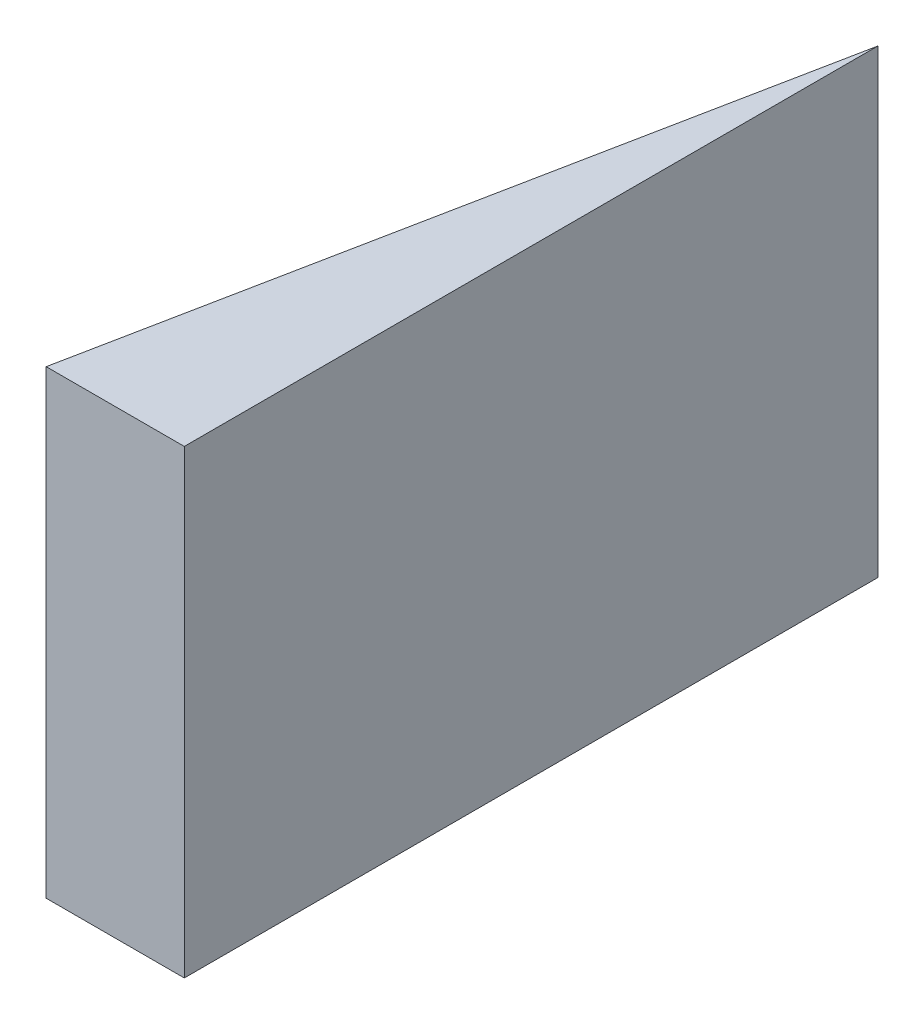
ISO-10303-21;
HEADER;
FILE_DESCRIPTION(('STEP AP214'),'2;1');
FILE_NAME('part.step','',(''),(''),'','','');
FILE_SCHEMA(('AUTOMOTIVE_DESIGN { 1 0 10303 214 1 1 1 1 }'));
ENDSEC;
DATA;
#1=APPLICATION_CONTEXT('core data for automotive mechanical design processes');
#2=APPLICATION_PROTOCOL_DEFINITION('international standard','automotive_design',2000,#1);
#3=PRODUCT_CONTEXT('',#1,'mechanical');
#4=PRODUCT('Part','Part','',(#3));
#5=PRODUCT_RELATED_PRODUCT_CATEGORY('part','',(#4));
#6=PRODUCT_DEFINITION_FORMATION('','',#4);
#7=PRODUCT_DEFINITION_CONTEXT('part definition',#1,'design');
#8=PRODUCT_DEFINITION('design','',#6,#7);
#9=PRODUCT_DEFINITION_SHAPE('','',#8);
#10=(LENGTH_UNIT() NAMED_UNIT(*) SI_UNIT(.MILLI.,.METRE.));
#11=(NAMED_UNIT(*) PLANE_ANGLE_UNIT() SI_UNIT($,.RADIAN.));
#12=(NAMED_UNIT(*) SI_UNIT($,.STERADIAN.) SOLID_ANGLE_UNIT());
#13=UNCERTAINTY_MEASURE_WITH_UNIT(LENGTH_MEASURE(1.E-05),#10,'distance_accuracy_value','');
#14=(GEOMETRIC_REPRESENTATION_CONTEXT(3) GLOBAL_UNCERTAINTY_ASSIGNED_CONTEXT((#13)) GLOBAL_UNIT_ASSIGNED_CONTEXT((#10,
#11,#12)) REPRESENTATION_CONTEXT('',''));
#15=CARTESIAN_POINT('',(0.,0.,0.));
#16=DIRECTION('',(0.,0.,1.));
#17=DIRECTION('',(1.,0.,0.));
#18=AXIS2_PLACEMENT_3D('',#15,#16,#17);
#19=CARTESIAN_POINT('',(-3.37532170631,1.74999995469266,-5.23287720051423));
#20=DIRECTION('',(0.,-1.,-8.74227765734759E-08));
#21=DIRECTION('',(1.,0.,0.));
#22=AXIS2_PLACEMENT_3D('',#19,#20,#21);
#23=PLANE('',#22);
#24=DIRECTION('',(-1.,0.,0.));
#25=VECTOR('',#24,1.);
#26=CARTESIAN_POINT('',(-3.,1.74999981641117,-3.65112136800623));
#27=LINE('',#26,#25);
#28=CARTESIAN_POINT('',(-3.,1.74999981641017,-3.65112136800623));
#29=VERTEX_POINT('',#28);
#30=CARTESIAN_POINT('',(-3.3,1.74999981641017,-3.65112136800723));
#31=VERTEX_POINT('',#30);
#32=EDGE_CURVE('E11',#29,#31,#27,.T.);
#33=ORIENTED_EDGE('',*,*,#32,.F.);
#34=DIRECTION('',(0.,-8.74227765663743E-08,0.999999999999996));
#35=VECTOR('',#34,1.);
#36=CARTESIAN_POINT('',(-3.,1.74999994810782,-5.15755549420424));
#37=LINE('',#36,#35);
#38=CARTESIAN_POINT('',(-3.,1.74999994810682,-5.15755549420324));
#39=VERTEX_POINT('',#38);
#40=EDGE_CURVE('E63',#39,#29,#37,.T.);
#41=ORIENTED_EDGE('',*,*,#40,.F.);
#42=DIRECTION('',(0.195310522456618,8.57391410123929E-08,-0.980741454114037));
#43=VECTOR('',#42,1.);
#44=CARTESIAN_POINT('',(-3.3,1.74999981641117,-3.65112136800623));
#45=LINE('',#44,#43);
#46=EDGE_CURVE('E70',#31,#39,#45,.T.);
#47=ORIENTED_EDGE('',*,*,#46,.F.);
#48=EDGE_LOOP('',(#33,#41,#47));
#49=FACE_BOUND('',#48,.T.);
#50=ADVANCED_FACE('F17',(#49),#23,.F.);
#51=CARTESIAN_POINT('',(-3.37532170631,0.749999954692656,-5.23287728793701));
#52=DIRECTION('',(0.,-1.,-8.74227765734759E-08));
#53=DIRECTION('',(1.,0.,0.));
#54=AXIS2_PLACEMENT_3D('',#51,#52,#53);
#55=PLANE('',#54);
#56=DIRECTION('',(0.195310522456618,8.57391410123928E-08,-0.980741454114037));
#57=VECTOR('',#56,1.);
#58=CARTESIAN_POINT('',(-3.3,0.749999816411169,-3.65112145542901));
#59=LINE('',#58,#57);
#60=CARTESIAN_POINT('',(-3.3,0.749999816412169,-3.65112145543001));
#61=VERTEX_POINT('',#60);
#62=CARTESIAN_POINT('',(-3.,0.749999948108823,-5.15755558162601));
#63=VERTEX_POINT('',#62);
#64=EDGE_CURVE('E24',#61,#63,#59,.T.);
#65=ORIENTED_EDGE('',*,*,#64,.T.);
#66=DIRECTION('',(0.,-8.74227765663743E-08,0.999999999999996));
#67=VECTOR('',#66,1.);
#68=CARTESIAN_POINT('',(-3.,0.749999948107823,-5.15755558162701));
#69=LINE('',#68,#67);
#70=CARTESIAN_POINT('',(-3.,0.749999816412169,-3.65112145542901));
#71=VERTEX_POINT('',#70);
#72=EDGE_CURVE('E49',#63,#71,#69,.T.);
#73=ORIENTED_EDGE('',*,*,#72,.T.);
#74=DIRECTION('',(-1.,0.,0.));
#75=VECTOR('',#74,1.);
#76=CARTESIAN_POINT('',(-3.,0.749999816411169,-3.65112145542901));
#77=LINE('',#76,#75);
#78=EDGE_CURVE('E46',#71,#61,#77,.T.);
#79=ORIENTED_EDGE('',*,*,#78,.T.);
#80=EDGE_LOOP('',(#65,#73,#79));
#81=FACE_BOUND('',#80,.T.);
#82=ADVANCED_FACE('F47',(#81),#55,.T.);
#83=CARTESIAN_POINT('',(-3.3,1.74999981641117,-3.65112136800623));
#84=DIRECTION('',(-0.980741454114041,1.70745881893227E-08,-0.195310522456619));
#85=DIRECTION('',(0.195310522456619,8.57391410193576E-08,-0.980741454114041));
#86=AXIS2_PLACEMENT_3D('',#83,#84,#85);
#87=PLANE('',#86);
#88=ORIENTED_EDGE('',*,*,#46,.T.);
#89=DIRECTION('',(0.,-0.999999999999996,-8.74227765734756E-08));
#90=VECTOR('',#89,1.);
#91=CARTESIAN_POINT('',(-3.,1.74999994810782,-5.15755549420423));
#92=LINE('',#91,#90);
#93=EDGE_CURVE('E54',#39,#63,#92,.T.);
#94=ORIENTED_EDGE('',*,*,#93,.T.);
#95=ORIENTED_EDGE('',*,*,#64,.F.);
#96=DIRECTION('',(0.,-0.999999999999996,-8.74227765734755E-08));
#97=VECTOR('',#96,1.);
#98=CARTESIAN_POINT('',(-3.3,1.74999981641117,-3.65112136800623));
#99=LINE('',#98,#97);
#100=EDGE_CURVE('E61',#31,#61,#99,.T.);
#101=ORIENTED_EDGE('',*,*,#100,.F.);
#102=EDGE_LOOP('',(#88,#94,#95,#101));
#103=FACE_BOUND('',#102,.T.);
#104=ADVANCED_FACE('F60',(#103),#87,.T.);
#105=CARTESIAN_POINT('',(-3.,1.74999994810782,-5.15755549420424));
#106=DIRECTION('',(1.,0.,0.));
#107=DIRECTION('',(0.,-8.74227765734759E-08,1.));
#108=AXIS2_PLACEMENT_3D('',#105,#106,#107);
#109=PLANE('',#108);
#110=ORIENTED_EDGE('',*,*,#40,.T.);
#111=DIRECTION('',(0.,-0.999999999999996,-8.74227765734755E-08));
#112=VECTOR('',#111,1.);
#113=CARTESIAN_POINT('',(-3.,1.74999981641117,-3.65112136800624));
#114=LINE('',#113,#112);
#115=EDGE_CURVE('E55',#29,#71,#114,.T.);
#116=ORIENTED_EDGE('',*,*,#115,.T.);
#117=ORIENTED_EDGE('',*,*,#72,.F.);
#118=ORIENTED_EDGE('',*,*,#93,.F.);
#119=EDGE_LOOP('',(#110,#116,#117,#118));
#120=FACE_BOUND('',#119,.T.);
#121=ADVANCED_FACE('F73',(#120),#109,.T.);
#122=CARTESIAN_POINT('',(-3.,1.74999981641117,-3.65112136800623));
#123=DIRECTION('',(0.,-8.74227765734759E-08,1.));
#124=DIRECTION('',(-1.,0.,0.));
#125=AXIS2_PLACEMENT_3D('',#122,#123,#124);
#126=PLANE('',#125);
#127=ORIENTED_EDGE('',*,*,#32,.T.);
#128=ORIENTED_EDGE('',*,*,#100,.T.);
#129=ORIENTED_EDGE('',*,*,#78,.F.);
#130=ORIENTED_EDGE('',*,*,#115,.F.);
#131=EDGE_LOOP('',(#127,#128,#129,#130));
#132=FACE_BOUND('',#131,.T.);
#133=ADVANCED_FACE('F64',(#132),#126,.T.);
#134=CLOSED_SHELL('',(#50,#82,#104,#121,#133));
#135=MANIFOLD_SOLID_BREP('B1',#134);
#136=ADVANCED_BREP_SHAPE_REPRESENTATION('',(#18,#135),#14);
#137=SHAPE_DEFINITION_REPRESENTATION(#9,#136);
ENDSEC;
END-ISO-10303-21;
